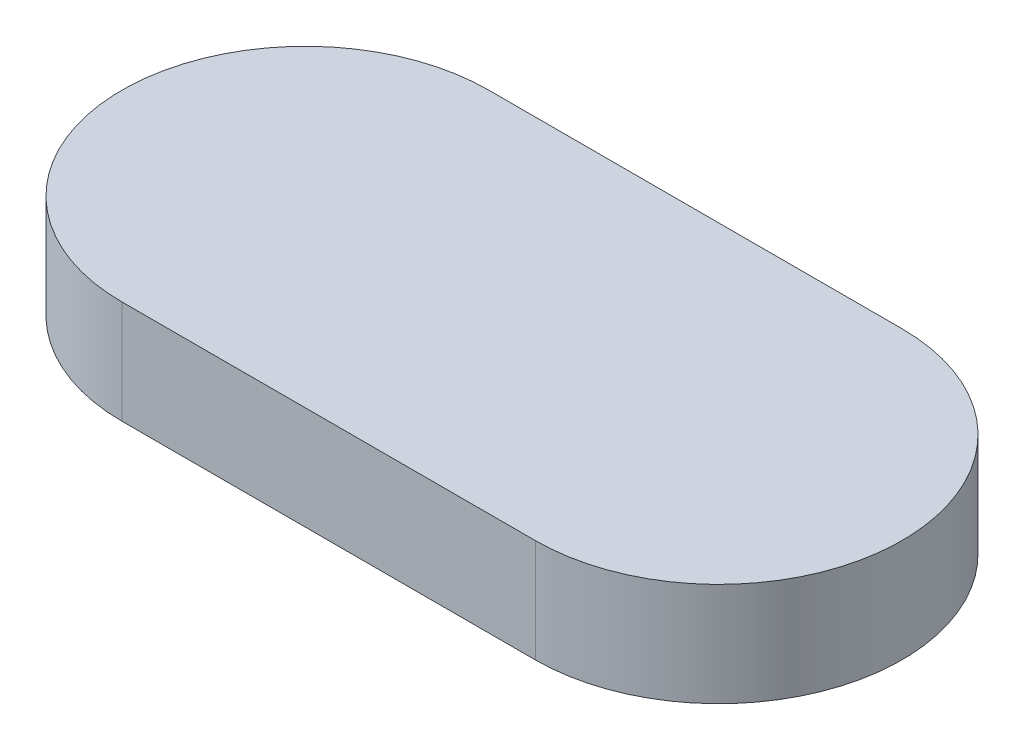
ISO-10303-21;
HEADER;
FILE_DESCRIPTION(('STEP AP214'),'2;1');
FILE_NAME('part.step','',(''),(''),'','','');
FILE_SCHEMA(('AUTOMOTIVE_DESIGN { 1 0 10303 214 1 1 1 1 }'));
ENDSEC;
DATA;
#1=APPLICATION_CONTEXT('core data for automotive mechanical design processes');
#2=APPLICATION_PROTOCOL_DEFINITION('international standard','automotive_design',2000,#1);
#3=PRODUCT_CONTEXT('',#1,'mechanical');
#4=PRODUCT('Part','Part','',(#3));
#5=PRODUCT_RELATED_PRODUCT_CATEGORY('part','',(#4));
#6=PRODUCT_DEFINITION_FORMATION('','',#4);
#7=PRODUCT_DEFINITION_CONTEXT('part definition',#1,'design');
#8=PRODUCT_DEFINITION('design','',#6,#7);
#9=PRODUCT_DEFINITION_SHAPE('','',#8);
#10=(LENGTH_UNIT() NAMED_UNIT(*) SI_UNIT(.MILLI.,.METRE.));
#11=(NAMED_UNIT(*) PLANE_ANGLE_UNIT() SI_UNIT($,.RADIAN.));
#12=(NAMED_UNIT(*) SI_UNIT($,.STERADIAN.) SOLID_ANGLE_UNIT());
#13=UNCERTAINTY_MEASURE_WITH_UNIT(LENGTH_MEASURE(1.E-05),#10,'distance_accuracy_value','');
#14=(GEOMETRIC_REPRESENTATION_CONTEXT(3) GLOBAL_UNCERTAINTY_ASSIGNED_CONTEXT((#13)) GLOBAL_UNIT_ASSIGNED_CONTEXT((#10,
#11,#12)) REPRESENTATION_CONTEXT('',''));
#15=CARTESIAN_POINT('',(0.,0.,0.));
#16=DIRECTION('',(0.,0.,1.));
#17=DIRECTION('',(1.,0.,0.));
#18=AXIS2_PLACEMENT_3D('',#15,#16,#17);
#19=CARTESIAN_POINT('',(-10.,5.,0.));
#20=DIRECTION('',(0.,-1.,0.));
#21=DIRECTION('',(0.,0.,-1.));
#22=AXIS2_PLACEMENT_3D('',#19,#20,#21);
#23=CYLINDRICAL_SURFACE('',#22,8.875);
#24=CARTESIAN_POINT('',(-10.,0.,0.));
#25=DIRECTION('',(0.,1.,0.));
#26=DIRECTION('',(0.,0.,1.));
#27=AXIS2_PLACEMENT_3D('',#24,#25,#26);
#28=CIRCLE('',#27,8.875);
#29=CARTESIAN_POINT('',(-10.,0.,-8.875));
#30=VERTEX_POINT('',#29);
#31=CARTESIAN_POINT('',(-10.,0.,8.875));
#32=VERTEX_POINT('',#31);
#33=EDGE_CURVE('E100',#30,#32,#28,.T.);
#34=ORIENTED_EDGE('',*,*,#33,.T.);
#35=DIRECTION('',(0.,-1.,0.));
#36=VECTOR('',#35,1.);
#37=CARTESIAN_POINT('',(-10.,5.,8.875));
#38=LINE('',#37,#36);
#39=CARTESIAN_POINT('',(-10.,5.,8.875));
#40=VERTEX_POINT('',#39);
#41=EDGE_CURVE('E11',#40,#32,#38,.T.);
#42=ORIENTED_EDGE('',*,*,#41,.F.);
#43=CARTESIAN_POINT('',(-10.,5.,0.));
#44=DIRECTION('',(0.,1.,0.));
#45=DIRECTION('',(0.,0.,1.));
#46=AXIS2_PLACEMENT_3D('',#43,#44,#45);
#47=CIRCLE('',#46,8.875);
#48=CARTESIAN_POINT('',(-10.,5.,-8.875));
#49=VERTEX_POINT('',#48);
#50=EDGE_CURVE('E88',#49,#40,#47,.T.);
#51=ORIENTED_EDGE('',*,*,#50,.F.);
#52=DIRECTION('',(0.,-1.,0.));
#53=VECTOR('',#52,1.);
#54=CARTESIAN_POINT('',(-10.,5.,-8.875));
#55=LINE('',#54,#53);
#56=EDGE_CURVE('E96',#49,#30,#55,.T.);
#57=ORIENTED_EDGE('',*,*,#56,.T.);
#58=EDGE_LOOP('',(#34,#42,#51,#57));
#59=FACE_BOUND('',#58,.T.);
#60=ADVANCED_FACE('F37',(#59),#23,.T.);
#61=CARTESIAN_POINT('',(-10.,5.,8.875));
#62=DIRECTION('',(0.,0.,-1.));
#63=DIRECTION('',(-1.,0.,0.));
#64=AXIS2_PLACEMENT_3D('',#61,#62,#63);
#65=PLANE('',#64);
#66=DIRECTION('',(1.,0.,0.));
#67=VECTOR('',#66,1.);
#68=CARTESIAN_POINT('',(-10.,0.,8.875));
#69=LINE('',#68,#67);
#70=CARTESIAN_POINT('',(10.,0.,8.875));
#71=VERTEX_POINT('',#70);
#72=EDGE_CURVE('E92',#32,#71,#69,.T.);
#73=ORIENTED_EDGE('',*,*,#72,.T.);
#74=DIRECTION('',(0.,-1.,0.));
#75=VECTOR('',#74,1.);
#76=CARTESIAN_POINT('',(10.,5.,8.875));
#77=LINE('',#76,#75);
#78=CARTESIAN_POINT('',(10.,5.,8.875));
#79=VERTEX_POINT('',#78);
#80=EDGE_CURVE('E45',#79,#71,#77,.T.);
#81=ORIENTED_EDGE('',*,*,#80,.F.);
#82=DIRECTION('',(1.,0.,0.));
#83=VECTOR('',#82,1.);
#84=CARTESIAN_POINT('',(-10.,5.,8.875));
#85=LINE('',#84,#83);
#86=EDGE_CURVE('E83',#40,#79,#85,.T.);
#87=ORIENTED_EDGE('',*,*,#86,.F.);
#88=ORIENTED_EDGE('',*,*,#41,.T.);
#89=EDGE_LOOP('',(#73,#81,#87,#88));
#90=FACE_BOUND('',#89,.T.);
#91=ADVANCED_FACE('F91',(#90),#65,.F.);
#92=CARTESIAN_POINT('',(10.,5.,0.));
#93=DIRECTION('',(0.,-1.,0.));
#94=DIRECTION('',(0.,0.,-1.));
#95=AXIS2_PLACEMENT_3D('',#92,#93,#94);
#96=CYLINDRICAL_SURFACE('',#95,8.875);
#97=CARTESIAN_POINT('',(10.,0.,0.));
#98=DIRECTION('',(0.,1.,0.));
#99=DIRECTION('',(0.,0.,1.));
#100=AXIS2_PLACEMENT_3D('',#97,#98,#99);
#101=CIRCLE('',#100,8.875);
#102=CARTESIAN_POINT('',(10.,0.,-8.875));
#103=VERTEX_POINT('',#102);
#104=EDGE_CURVE('E70',#71,#103,#101,.T.);
#105=ORIENTED_EDGE('',*,*,#104,.T.);
#106=DIRECTION('',(0.,-1.,0.));
#107=VECTOR('',#106,1.);
#108=CARTESIAN_POINT('',(10.,5.,-8.875));
#109=LINE('',#108,#107);
#110=CARTESIAN_POINT('',(10.,5.,-8.875));
#111=VERTEX_POINT('',#110);
#112=EDGE_CURVE('E93',#111,#103,#109,.T.);
#113=ORIENTED_EDGE('',*,*,#112,.F.);
#114=CARTESIAN_POINT('',(10.,5.,0.));
#115=DIRECTION('',(0.,1.,0.));
#116=DIRECTION('',(0.,0.,1.));
#117=AXIS2_PLACEMENT_3D('',#114,#115,#116);
#118=CIRCLE('',#117,8.875);
#119=EDGE_CURVE('E86',#79,#111,#118,.T.);
#120=ORIENTED_EDGE('',*,*,#119,.F.);
#121=ORIENTED_EDGE('',*,*,#80,.T.);
#122=EDGE_LOOP('',(#105,#113,#120,#121));
#123=FACE_BOUND('',#122,.T.);
#124=ADVANCED_FACE('F94',(#123),#96,.T.);
#125=CARTESIAN_POINT('',(-10.,5.,-8.875));
#126=DIRECTION('',(0.,0.,1.));
#127=DIRECTION('',(1.,0.,0.));
#128=AXIS2_PLACEMENT_3D('',#125,#126,#127);
#129=PLANE('',#128);
#130=DIRECTION('',(-1.,0.,0.));
#131=VECTOR('',#130,1.);
#132=CARTESIAN_POINT('',(-10.,0.,-8.875));
#133=LINE('',#132,#131);
#134=EDGE_CURVE('E76',#103,#30,#133,.T.);
#135=ORIENTED_EDGE('',*,*,#134,.T.);
#136=ORIENTED_EDGE('',*,*,#56,.F.);
#137=DIRECTION('',(-1.,0.,0.));
#138=VECTOR('',#137,1.);
#139=CARTESIAN_POINT('',(-10.,5.,-8.875));
#140=LINE('',#139,#138);
#141=EDGE_CURVE('E53',#111,#49,#140,.T.);
#142=ORIENTED_EDGE('',*,*,#141,.F.);
#143=ORIENTED_EDGE('',*,*,#112,.T.);
#144=EDGE_LOOP('',(#135,#136,#142,#143));
#145=FACE_BOUND('',#144,.T.);
#146=ADVANCED_FACE('F107',(#145),#129,.F.);
#147=CARTESIAN_POINT('',(-10.,5.,0.));
#148=DIRECTION('',(0.,1.,0.));
#149=DIRECTION('',(0.,0.,1.));
#150=AXIS2_PLACEMENT_3D('',#147,#148,#149);
#151=PLANE('',#150);
#152=ORIENTED_EDGE('',*,*,#50,.T.);
#153=ORIENTED_EDGE('',*,*,#86,.T.);
#154=ORIENTED_EDGE('',*,*,#119,.T.);
#155=ORIENTED_EDGE('',*,*,#141,.T.);
#156=EDGE_LOOP('',(#152,#153,#154,#155));
#157=FACE_BOUND('',#156,.T.);
#158=ADVANCED_FACE('F84',(#157),#151,.T.);
#159=CARTESIAN_POINT('',(-10.,0.,0.));
#160=DIRECTION('',(0.,1.,0.));
#161=DIRECTION('',(0.,0.,1.));
#162=AXIS2_PLACEMENT_3D('',#159,#160,#161);
#163=PLANE('',#162);
#164=ORIENTED_EDGE('',*,*,#33,.F.);
#165=ORIENTED_EDGE('',*,*,#134,.F.);
#166=ORIENTED_EDGE('',*,*,#104,.F.);
#167=ORIENTED_EDGE('',*,*,#72,.F.);
#168=EDGE_LOOP('',(#164,#165,#166,#167));
#169=FACE_BOUND('',#168,.T.);
#170=ADVANCED_FACE('F110',(#169),#163,.F.);
#171=CLOSED_SHELL('',(#60,#91,#124,#146,#158,#170));
#172=MANIFOLD_SOLID_BREP('B2',#171);
#173=ADVANCED_BREP_SHAPE_REPRESENTATION('',(#18,#172),#14);
#174=SHAPE_DEFINITION_REPRESENTATION(#9,#173);
ENDSEC;
END-ISO-10303-21;
